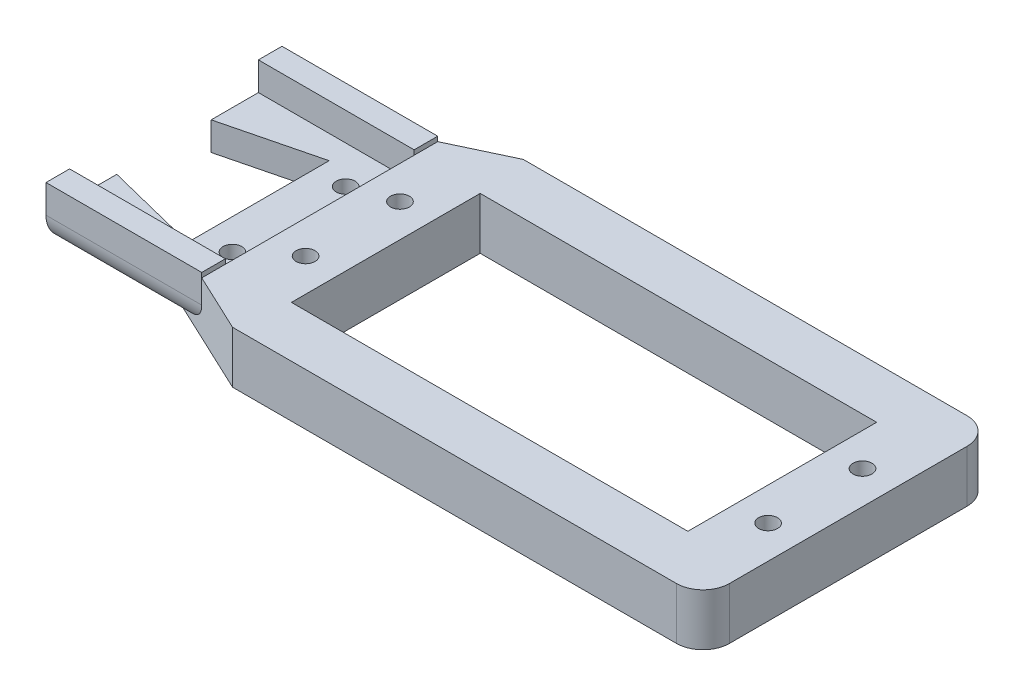
ISO-10303-21;
HEADER;
FILE_DESCRIPTION(('STEP AP214'),'2;1');
FILE_NAME('part.step','',(''),(''),'','','');
FILE_SCHEMA(('AUTOMOTIVE_DESIGN { 1 0 10303 214 1 1 1 1 }'));
ENDSEC;
DATA;
#1=APPLICATION_CONTEXT('core data for automotive mechanical design processes');
#2=APPLICATION_PROTOCOL_DEFINITION('international standard','automotive_design',2000,#1);
#3=PRODUCT_CONTEXT('',#1,'mechanical');
#4=PRODUCT('Part','Part','',(#3));
#5=PRODUCT_RELATED_PRODUCT_CATEGORY('part','',(#4));
#6=PRODUCT_DEFINITION_FORMATION('','',#4);
#7=PRODUCT_DEFINITION_CONTEXT('part definition',#1,'design');
#8=PRODUCT_DEFINITION('design','',#6,#7);
#9=PRODUCT_DEFINITION_SHAPE('','',#8);
#10=(LENGTH_UNIT() NAMED_UNIT(*) SI_UNIT(.MILLI.,.METRE.));
#11=(NAMED_UNIT(*) PLANE_ANGLE_UNIT() SI_UNIT($,.RADIAN.));
#12=(NAMED_UNIT(*) SI_UNIT($,.STERADIAN.) SOLID_ANGLE_UNIT());
#13=UNCERTAINTY_MEASURE_WITH_UNIT(LENGTH_MEASURE(1.E-05),#10,'distance_accuracy_value','');
#14=(GEOMETRIC_REPRESENTATION_CONTEXT(3) GLOBAL_UNCERTAINTY_ASSIGNED_CONTEXT((#13)) GLOBAL_UNIT_ASSIGNED_CONTEXT((#10,
#11,#12)) REPRESENTATION_CONTEXT('',''));
#15=CARTESIAN_POINT('',(0.,0.,0.));
#16=DIRECTION('',(0.,0.,1.));
#17=DIRECTION('',(1.,0.,0.));
#18=AXIS2_PLACEMENT_3D('',#15,#16,#17);
#19=CARTESIAN_POINT('',(-35.503347098961,5.5,-5.12411535777367));
#20=DIRECTION('',(-0.24253562503647,0.,-0.970142500145298));
#21=DIRECTION('',(-0.970142500145298,0.,0.24253562503647));
#22=AXIS2_PLACEMENT_3D('',#19,#20,#21);
#23=PLANE('',#22);
#24=DIRECTION('',(0.970142500145298,0.,-0.24253562503647));
#25=VECTOR('',#24,1.);
#26=CARTESIAN_POINT('',(-35.503347098961,3.,-5.12411535777367));
#27=LINE('',#26,#25);
#28=CARTESIAN_POINT('',(-35.503347098961,3.,-5.12411535777367));
#29=VERTEX_POINT('',#28);
#30=CARTESIAN_POINT('',(-25.504346549651,3.,-7.62386549510267));
#31=VERTEX_POINT('',#30);
#32=EDGE_CURVE('E272',#29,#31,#27,.T.);
#33=ORIENTED_EDGE('',*,*,#32,.F.);
#34=DIRECTION('',(0.,-1.,0.));
#35=VECTOR('',#34,1.);
#36=CARTESIAN_POINT('',(-35.503347098961,5.5,-5.12411535777367));
#37=LINE('',#36,#35);
#38=CARTESIAN_POINT('',(-35.503347098961,0.,-5.12411535777367));
#39=VERTEX_POINT('',#38);
#40=EDGE_CURVE('E510',#29,#39,#37,.T.);
#41=ORIENTED_EDGE('',*,*,#40,.T.);
#42=DIRECTION('',(0.970142500145298,0.,-0.24253562503647));
#43=VECTOR('',#42,1.);
#44=CARTESIAN_POINT('',(-35.503347098961,0.,-5.12411535777367));
#45=LINE('',#44,#43);
#46=CARTESIAN_POINT('',(-25.504346549651,0.,-7.62386549510267));
#47=VERTEX_POINT('',#46);
#48=EDGE_CURVE('E432',#39,#47,#45,.T.);
#49=ORIENTED_EDGE('',*,*,#48,.T.);
#50=DIRECTION('',(0.,-1.,0.));
#51=VECTOR('',#50,1.);
#52=CARTESIAN_POINT('',(-25.504346549651,5.5,-7.62386549510267));
#53=LINE('',#52,#51);
#54=EDGE_CURVE('E507',#31,#47,#53,.T.);
#55=ORIENTED_EDGE('',*,*,#54,.F.);
#56=EDGE_LOOP('',(#33,#41,#49,#55));
#57=FACE_BOUND('',#56,.T.);
#58=ADVANCED_FACE('F39',(#57),#23,.F.);
#59=CARTESIAN_POINT('',(-25.504346549651,5.5,-7.62386549510267));
#60=DIRECTION('',(1.,0.,0.));
#61=DIRECTION('',(0.,0.,-1.));
#62=AXIS2_PLACEMENT_3D('',#59,#60,#61);
#63=PLANE('',#62);
#64=DIRECTION('',(0.,0.,1.));
#65=VECTOR('',#64,1.);
#66=CARTESIAN_POINT('',(-25.504346549651,3.,-7.62386549510267));
#67=LINE('',#66,#65);
#68=CARTESIAN_POINT('',(-25.504346549651,3.,7.37613450489733));
#69=VERTEX_POINT('',#68);
#70=EDGE_CURVE('E269',#31,#69,#67,.T.);
#71=ORIENTED_EDGE('',*,*,#70,.F.);
#72=ORIENTED_EDGE('',*,*,#54,.T.);
#73=DIRECTION('',(0.,0.,1.));
#74=VECTOR('',#73,1.);
#75=CARTESIAN_POINT('',(-25.504346549651,0.,-7.62386549510267));
#76=LINE('',#75,#74);
#77=CARTESIAN_POINT('',(-25.504346549651,0.,7.37613450489733));
#78=VERTEX_POINT('',#77);
#79=EDGE_CURVE('E436',#47,#78,#76,.T.);
#80=ORIENTED_EDGE('',*,*,#79,.T.);
#81=DIRECTION('',(0.,-1.,0.));
#82=VECTOR('',#81,1.);
#83=CARTESIAN_POINT('',(-25.504346549651,5.5,7.37613450489733));
#84=LINE('',#83,#82);
#85=EDGE_CURVE('E504',#69,#78,#84,.T.);
#86=ORIENTED_EDGE('',*,*,#85,.F.);
#87=EDGE_LOOP('',(#71,#72,#80,#86));
#88=FACE_BOUND('',#87,.T.);
#89=ADVANCED_FACE('F640',(#88),#63,.F.);
#90=CARTESIAN_POINT('',(-25.504346549651,5.5,7.37613450489733));
#91=DIRECTION('',(-0.24253562503647,0.,0.970142500145298));
#92=DIRECTION('',(0.970142500145298,0.,0.24253562503647));
#93=AXIS2_PLACEMENT_3D('',#90,#91,#92);
#94=PLANE('',#93);
#95=DIRECTION('',(-0.970142500145298,0.,-0.24253562503647));
#96=VECTOR('',#95,1.);
#97=CARTESIAN_POINT('',(-25.504346549651,3.,7.37613450489733));
#98=LINE('',#97,#96);
#99=CARTESIAN_POINT('',(-35.503347098961,3.,4.87638436756833));
#100=VERTEX_POINT('',#99);
#101=EDGE_CURVE('E234',#69,#100,#98,.T.);
#102=ORIENTED_EDGE('',*,*,#101,.F.);
#103=ORIENTED_EDGE('',*,*,#85,.T.);
#104=DIRECTION('',(-0.970142500145298,0.,-0.24253562503647));
#105=VECTOR('',#104,1.);
#106=CARTESIAN_POINT('',(-25.504346549651,0.,7.37613450489733));
#107=LINE('',#106,#105);
#108=CARTESIAN_POINT('',(-35.503347098961,0.,4.87638436756833));
#109=VERTEX_POINT('',#108);
#110=EDGE_CURVE('E440',#78,#109,#107,.T.);
#111=ORIENTED_EDGE('',*,*,#110,.T.);
#112=DIRECTION('',(0.,-1.,0.));
#113=VECTOR('',#112,1.);
#114=CARTESIAN_POINT('',(-35.503347098961,5.5,4.87638436756833));
#115=LINE('',#114,#113);
#116=EDGE_CURVE('E501',#100,#109,#115,.T.);
#117=ORIENTED_EDGE('',*,*,#116,.F.);
#118=EDGE_LOOP('',(#102,#103,#111,#117));
#119=FACE_BOUND('',#118,.T.);
#120=ADVANCED_FACE('F645',(#119),#94,.F.);
#121=CARTESIAN_POINT('',(-22.2543463720277,5.5,-6.1238652786694));
#122=DIRECTION('',(0.,-1.,0.));
#123=DIRECTION('',(0.,0.,-1.));
#124=AXIS2_PLACEMENT_3D('',#121,#122,#123);
#125=CYLINDRICAL_SURFACE('',#124,1.00000021643328);
#126=CARTESIAN_POINT('',(-22.2543463720277,0.,-6.1238652786694));
#127=DIRECTION('',(0.,1.,0.));
#128=DIRECTION('',(0.,0.,1.));
#129=AXIS2_PLACEMENT_3D('',#126,#127,#128);
#130=CIRCLE('',#129,1.00000021643328);
#131=CARTESIAN_POINT('',(-22.2543463720277,0.,-5.12386506223612));
#132=VERTEX_POINT('',#131);
#133=EDGE_CURVE('E356',#132,#132,#130,.T.);
#134=ORIENTED_EDGE('',*,*,#133,.F.);
#135=EDGE_LOOP('',(#134));
#136=FACE_BOUND('',#135,.T.);
#137=CARTESIAN_POINT('',(-22.2543463720277,3.,-6.1238652786694));
#138=DIRECTION('',(0.,1.,0.));
#139=DIRECTION('',(0.,0.,1.));
#140=AXIS2_PLACEMENT_3D('',#137,#138,#139);
#141=CIRCLE('',#140,1.00000021643328);
#142=CARTESIAN_POINT('',(-22.2543463720277,3.,-5.12386506223612));
#143=VERTEX_POINT('',#142);
#144=EDGE_CURVE('E263',#143,#143,#141,.T.);
#145=ORIENTED_EDGE('',*,*,#144,.T.);
#146=EDGE_LOOP('',(#145));
#147=FACE_BOUND('',#146,.T.);
#148=ADVANCED_FACE('F881',(#136,#147),#125,.F.);
#149=CARTESIAN_POINT('',(-22.2543454835007,5.5,5.8761350910162));
#150=DIRECTION('',(0.,-1.,0.));
#151=DIRECTION('',(0.,0.,-1.));
#152=AXIS2_PLACEMENT_3D('',#149,#150,#151);
#153=CYLINDRICAL_SURFACE('',#152,1.00000059267607);
#154=CARTESIAN_POINT('',(-22.2543454835007,0.,5.8761350910162));
#155=DIRECTION('',(0.,1.,0.));
#156=DIRECTION('',(0.,0.,1.));
#157=AXIS2_PLACEMENT_3D('',#154,#155,#156);
#158=CIRCLE('',#157,1.00000059267607);
#159=CARTESIAN_POINT('',(-22.2543454835007,0.,6.87613568369227));
#160=VERTEX_POINT('',#159);
#161=EDGE_CURVE('E323',#160,#160,#158,.T.);
#162=ORIENTED_EDGE('',*,*,#161,.F.);
#163=EDGE_LOOP('',(#162));
#164=FACE_BOUND('',#163,.T.);
#165=CARTESIAN_POINT('',(-22.2543454835007,3.,5.8761350910162));
#166=DIRECTION('',(0.,1.,0.));
#167=DIRECTION('',(0.,0.,1.));
#168=AXIS2_PLACEMENT_3D('',#165,#166,#167);
#169=CIRCLE('',#168,1.00000059267607);
#170=CARTESIAN_POINT('',(-22.2543454835007,3.,6.87613568369227));
#171=VERTEX_POINT('',#170);
#172=EDGE_CURVE('E260',#171,#171,#169,.T.);
#173=ORIENTED_EDGE('',*,*,#172,.T.);
#174=EDGE_LOOP('',(#173));
#175=FACE_BOUND('',#174,.T.);
#176=ADVANCED_FACE('F844',(#164,#175),#153,.F.);
#177=CARTESIAN_POINT('',(34.1836718745476,5.5,12.4641535012919));
#178=DIRECTION('',(0.,1.,0.));
#179=DIRECTION('',(0.,0.,1.));
#180=AXIS2_PLACEMENT_3D('',#177,#178,#179);
#181=PLANE('',#180);
#182=DIRECTION('',(0.,0.,-1.));
#183=VECTOR('',#182,1.);
#184=CARTESIAN_POINT('',(-19.003347098961,5.5,-10.1238654951027));
#185=LINE('',#184,#183);
#186=CARTESIAN_POINT('',(-19.003347098961,5.5,9.87613450489733));
#187=VERTEX_POINT('',#186);
#188=CARTESIAN_POINT('',(-19.003347098961,5.5,-10.1238654951027));
#189=VERTEX_POINT('',#188);
#190=EDGE_CURVE('E237',#187,#189,#185,.T.);
#191=ORIENTED_EDGE('',*,*,#190,.F.);
#192=DIRECTION('',(0.,0.,-1.));
#193=VECTOR('',#192,1.);
#194=CARTESIAN_POINT('',(-19.003347098961,5.5,12.3761345048973));
#195=LINE('',#194,#193);
#196=CARTESIAN_POINT('',(-19.003347098961,5.5,12.3761345048973));
#197=VERTEX_POINT('',#196);
#198=EDGE_CURVE('E303',#197,#187,#195,.T.);
#199=ORIENTED_EDGE('',*,*,#198,.F.);
#200=DIRECTION('',(0.904851322774388,0.,0.425727710718296));
#201=VECTOR('',#200,1.);
#202=CARTESIAN_POINT('',(-19.003347098961,5.5,12.3761345048973));
#203=LINE('',#202,#201);
#204=CARTESIAN_POINT('',(-12.839622199671,5.5,15.2761341234273));
#205=VERTEX_POINT('',#204);
#206=EDGE_CURVE('E407',#197,#205,#203,.T.);
#207=ORIENTED_EDGE('',*,*,#206,.T.);
#208=DIRECTION('',(0.999999992076792,0.,-0.000125882545951451));
#209=VECTOR('',#208,1.);
#210=CARTESIAN_POINT('',(-12.839622199671,5.5,15.2761341234273));
#211=LINE('',#210,#209);
#212=CARTESIAN_POINT('',(34.184025108674,5.5,15.2702146669373));
#213=VERTEX_POINT('',#212);
#214=EDGE_CURVE('E410',#205,#213,#211,.T.);
#215=ORIENTED_EDGE('',*,*,#214,.T.);
#216=CARTESIAN_POINT('',(34.1836718745476,5.5,12.4641535012919));
#217=DIRECTION('',(0.,1.,0.));
#218=DIRECTION('',(0.,0.,1.));
#219=AXIS2_PLACEMENT_3D('',#216,#217,#218);
#220=CIRCLE('',#219,2.80606118787843);
#221=CARTESIAN_POINT('',(36.989733040193,5.5,12.4645067354273));
#222=VERTEX_POINT('',#221);
#223=EDGE_CURVE('E414',#213,#222,#220,.T.);
#224=ORIENTED_EDGE('',*,*,#223,.T.);
#225=DIRECTION('',(0.,0.,-1.));
#226=VECTOR('',#225,1.);
#227=CARTESIAN_POINT('',(36.989733040193,5.5,12.4645067354273));
#228=LINE('',#227,#226);
#229=CARTESIAN_POINT('',(36.989733040193,5.5,-12.7122377256327));
#230=VERTEX_POINT('',#229);
#231=EDGE_CURVE('E417',#222,#230,#228,.T.);
#232=ORIENTED_EDGE('',*,*,#231,.T.);
#233=CARTESIAN_POINT('',(34.184025108675,5.5,-12.7122377256327));
#234=DIRECTION('',(0.,1.,0.));
#235=DIRECTION('',(0.,0.,1.));
#236=AXIS2_PLACEMENT_3D('',#233,#234,#235);
#237=CIRCLE('',#236,2.805707931518);
#238=CARTESIAN_POINT('',(34.184025108674,5.5,-15.5179456571507));
#239=VERTEX_POINT('',#238);
#240=EDGE_CURVE('E420',#230,#239,#237,.T.);
#241=ORIENTED_EDGE('',*,*,#240,.T.);
#242=DIRECTION('',(-0.999999992076792,0.,-0.000125882545781312));
#243=VECTOR('',#242,1.);
#244=CARTESIAN_POINT('',(34.184025108674,5.5,-15.5179456571507));
#245=LINE('',#244,#243);
#246=CARTESIAN_POINT('',(-12.839622199671,5.5,-15.5238651136327));
#247=VERTEX_POINT('',#246);
#248=EDGE_CURVE('E423',#239,#247,#245,.T.);
#249=ORIENTED_EDGE('',*,*,#248,.T.);
#250=DIRECTION('',(-0.904851322774388,0.,0.425727710718296));
#251=VECTOR('',#250,1.);
#252=CARTESIAN_POINT('',(-12.839622199671,5.5,-15.5238651136327));
#253=LINE('',#252,#251);
#254=CARTESIAN_POINT('',(-19.003347098961,5.5,-12.6238654951027));
#255=VERTEX_POINT('',#254);
#256=EDGE_CURVE('E426',#247,#255,#253,.T.);
#257=ORIENTED_EDGE('',*,*,#256,.T.);
#258=DIRECTION('',(0.,0.,-1.));
#259=VECTOR('',#258,1.);
#260=CARTESIAN_POINT('',(-19.003347098961,5.5,-12.6238654951027));
#261=LINE('',#260,#259);
#262=EDGE_CURVE('E275',#189,#255,#261,.T.);
#263=ORIENTED_EDGE('',*,*,#262,.F.);
#264=EDGE_LOOP('',(#191,#199,#207,#215,#224,#232,#241,#249,#257,#263));
#265=FACE_BOUND('',#264,.T.);
#266=CARTESIAN_POINT('',(-15.5043476779818,5.5,4.87613492696322));
#267=DIRECTION('',(0.,1.,0.));
#268=DIRECTION('',(0.,0.,1.));
#269=AXIS2_PLACEMENT_3D('',#266,#267,#268);
#270=CIRCLE('',#269,1.00000042442782);
#271=CARTESIAN_POINT('',(-15.5043476779818,5.5,5.87613535139104));
#272=VERTEX_POINT('',#271);
#273=EDGE_CURVE('E328',#272,#272,#270,.T.);
#274=ORIENTED_EDGE('',*,*,#273,.F.);
#275=EDGE_LOOP('',(#274));
#276=FACE_BOUND('',#275,.T.);
#277=CARTESIAN_POINT('',(33.4956533773743,5.5,-5.12386556807738));
#278=DIRECTION('',(0.,1.,0.));
#279=DIRECTION('',(0.,0.,1.));
#280=AXIS2_PLACEMENT_3D('',#277,#278,#279);
#281=CIRCLE('',#280,1.00000007297471);
#282=CARTESIAN_POINT('',(33.4956533773743,5.5,-4.12386549510266));
#283=VERTEX_POINT('',#282);
#284=EDGE_CURVE('E344',#283,#283,#281,.T.);
#285=ORIENTED_EDGE('',*,*,#284,.F.);
#286=EDGE_LOOP('',(#285));
#287=FACE_BOUND('',#286,.T.);
#288=DIRECTION('',(1.,0.,0.));
#289=VECTOR('',#288,1.);
#290=CARTESIAN_POINT('',(-12.004346549651,5.5,9.87613450489733));
#291=LINE('',#290,#289);
#292=CARTESIAN_POINT('',(-12.004346549651,5.5,9.87613450489733));
#293=VERTEX_POINT('',#292);
#294=CARTESIAN_POINT('',(29.995653450349,5.5,9.87613450489733));
#295=VERTEX_POINT('',#294);
#296=EDGE_CURVE('E367',#293,#295,#291,.T.);
#297=ORIENTED_EDGE('',*,*,#296,.F.);
#298=DIRECTION('',(0.,0.,1.));
#299=VECTOR('',#298,1.);
#300=CARTESIAN_POINT('',(-12.004346549651,5.5,-10.1238654951027));
#301=LINE('',#300,#299);
#302=CARTESIAN_POINT('',(-12.004346549651,5.5,-10.1238654951027));
#303=VERTEX_POINT('',#302);
#304=EDGE_CURVE('E364',#303,#293,#301,.T.);
#305=ORIENTED_EDGE('',*,*,#304,.F.);
#306=DIRECTION('',(-1.,0.,0.));
#307=VECTOR('',#306,1.);
#308=CARTESIAN_POINT('',(-12.004346549651,5.5,-10.1238654951027));
#309=LINE('',#308,#307);
#310=CARTESIAN_POINT('',(29.995653450349,5.5,-10.1238654951027));
#311=VERTEX_POINT('',#310);
#312=EDGE_CURVE('E375',#311,#303,#309,.T.);
#313=ORIENTED_EDGE('',*,*,#312,.F.);
#314=DIRECTION('',(0.,0.,-1.));
#315=VECTOR('',#314,1.);
#316=CARTESIAN_POINT('',(29.995653450349,5.5,-10.1238654951027));
#317=LINE('',#316,#315);
#318=EDGE_CURVE('E371',#295,#311,#317,.T.);
#319=ORIENTED_EDGE('',*,*,#318,.F.);
#320=EDGE_LOOP('',(#297,#305,#313,#319));
#321=FACE_BOUND('',#320,.T.);
#322=CARTESIAN_POINT('',(-15.5043468388761,5.5,-5.12386555816893));
#323=DIRECTION('',(0.,1.,0.));
#324=DIRECTION('',(0.,0.,1.));
#325=AXIS2_PLACEMENT_3D('',#322,#323,#324);
#326=CIRCLE('',#325,1.00000006306631);
#327=CARTESIAN_POINT('',(-15.5043468388761,5.5,-4.12386549510263));
#328=VERTEX_POINT('',#327);
#329=EDGE_CURVE('E352',#328,#328,#326,.T.);
#330=ORIENTED_EDGE('',*,*,#329,.F.);
#331=EDGE_LOOP('',(#330));
#332=FACE_BOUND('',#331,.T.);
#333=CARTESIAN_POINT('',(33.4956530999563,5.5,4.87613399686961));
#334=DIRECTION('',(0.,1.,0.));
#335=DIRECTION('',(0.,0.,1.));
#336=AXIS2_PLACEMENT_3D('',#333,#334,#335);
#337=CIRCLE('',#336,0.999999978686177);
#338=CARTESIAN_POINT('',(33.4956530999563,5.5,5.87613397555579));
#339=VERTEX_POINT('',#338);
#340=EDGE_CURVE('E336',#339,#339,#337,.T.);
#341=ORIENTED_EDGE('',*,*,#340,.F.);
#342=EDGE_LOOP('',(#341));
#343=FACE_BOUND('',#342,.T.);
#344=ADVANCED_FACE('F584',(#265,#276,#287,#321,#332,#343),#181,.T.);
#345=CARTESIAN_POINT('',(34.1836718745476,0.,12.4641535012919));
#346=DIRECTION('',(0.,1.,0.));
#347=DIRECTION('',(0.,0.,1.));
#348=AXIS2_PLACEMENT_3D('',#345,#346,#347);
#349=PLANE('',#348);
#350=DIRECTION('',(0.,0.,1.));
#351=VECTOR('',#350,1.);
#352=CARTESIAN_POINT('',(-35.503347098961,0.,-12.6238654951027));
#353=LINE('',#352,#351);
#354=CARTESIAN_POINT('',(-35.503347098961,0.,-9.62386549510267));
#355=VERTEX_POINT('',#354);
#356=EDGE_CURVE('E406',#355,#39,#353,.T.);
#357=ORIENTED_EDGE('',*,*,#356,.F.);
#358=DIRECTION('',(-1.,0.,0.));
#359=VECTOR('',#358,1.);
#360=CARTESIAN_POINT('',(34.1836718745476,0.,-9.62386549510267));
#361=LINE('',#360,#359);
#362=CARTESIAN_POINT('',(-25.3796150749006,0.,-9.62386549510267));
#363=VERTEX_POINT('',#362);
#364=EDGE_CURVE('E531',#355,#363,#361,.F.);
#365=ORIENTED_EDGE('',*,*,#364,.T.);
#366=DIRECTION('',(-0.904851322774388,0.,0.425727710718296));
#367=VECTOR('',#366,1.);
#368=CARTESIAN_POINT('',(-12.839622199671,0.,-15.5238651136327));
#369=LINE('',#368,#367);
#370=CARTESIAN_POINT('',(-12.839622199671,0.,-15.5238651136327));
#371=VERTEX_POINT('',#370);
#372=EDGE_CURVE('E411',#371,#363,#369,.T.);
#373=ORIENTED_EDGE('',*,*,#372,.F.);
#374=DIRECTION('',(-0.999999992076792,0.,-0.000125882545781312));
#375=VECTOR('',#374,1.);
#376=CARTESIAN_POINT('',(34.184025108674,0.,-15.5179456571507));
#377=LINE('',#376,#375);
#378=CARTESIAN_POINT('',(34.184025108674,0.,-15.5179456571507));
#379=VERTEX_POINT('',#378);
#380=EDGE_CURVE('E462',#379,#371,#377,.T.);
#381=ORIENTED_EDGE('',*,*,#380,.F.);
#382=CARTESIAN_POINT('',(34.184025108675,0.,-12.7122377256327));
#383=DIRECTION('',(0.,1.,0.));
#384=DIRECTION('',(0.,0.,1.));
#385=AXIS2_PLACEMENT_3D('',#382,#383,#384);
#386=CIRCLE('',#385,2.805707931518);
#387=CARTESIAN_POINT('',(36.989733040193,0.,-12.7122377256327));
#388=VERTEX_POINT('',#387);
#389=EDGE_CURVE('E459',#388,#379,#386,.T.);
#390=ORIENTED_EDGE('',*,*,#389,.F.);
#391=DIRECTION('',(0.,0.,-1.));
#392=VECTOR('',#391,1.);
#393=CARTESIAN_POINT('',(36.989733040193,0.,12.4645067354273));
#394=LINE('',#393,#392);
#395=CARTESIAN_POINT('',(36.989733040193,0.,12.4645067354273));
#396=VERTEX_POINT('',#395);
#397=EDGE_CURVE('E456',#396,#388,#394,.T.);
#398=ORIENTED_EDGE('',*,*,#397,.F.);
#399=CARTESIAN_POINT('',(34.1836718745476,0.,12.4641535012919));
#400=DIRECTION('',(0.,1.,0.));
#401=DIRECTION('',(0.,0.,1.));
#402=AXIS2_PLACEMENT_3D('',#399,#400,#401);
#403=CIRCLE('',#402,2.80606118787843);
#404=CARTESIAN_POINT('',(34.184025108674,0.,15.2702146669373));
#405=VERTEX_POINT('',#404);
#406=EDGE_CURVE('E453',#405,#396,#403,.T.);
#407=ORIENTED_EDGE('',*,*,#406,.F.);
#408=DIRECTION('',(0.999999992076792,0.,-0.000125882545951451));
#409=VECTOR('',#408,1.);
#410=CARTESIAN_POINT('',(-12.839622199671,0.,15.2761341234273));
#411=LINE('',#410,#409);
#412=CARTESIAN_POINT('',(-12.839622199671,0.,15.2761341234273));
#413=VERTEX_POINT('',#412);
#414=EDGE_CURVE('E450',#413,#405,#411,.T.);
#415=ORIENTED_EDGE('',*,*,#414,.F.);
#416=DIRECTION('',(0.904851322774388,0.,0.425727710718296));
#417=VECTOR('',#416,1.);
#418=CARTESIAN_POINT('',(-19.003347098961,0.,12.3761345048973));
#419=LINE('',#418,#417);
#420=CARTESIAN_POINT('',(-25.3796150749006,0.,9.37613450489733));
#421=VERTEX_POINT('',#420);
#422=EDGE_CURVE('E447',#421,#413,#419,.T.);
#423=ORIENTED_EDGE('',*,*,#422,.F.);
#424=DIRECTION('',(1.,0.,0.));
#425=VECTOR('',#424,1.);
#426=CARTESIAN_POINT('',(34.1836718745476,0.,9.37613450489733));
#427=LINE('',#426,#425);
#428=CARTESIAN_POINT('',(-35.503347098961,0.,9.37613450489733));
#429=VERTEX_POINT('',#428);
#430=EDGE_CURVE('E528',#421,#429,#427,.F.);
#431=ORIENTED_EDGE('',*,*,#430,.T.);
#432=DIRECTION('',(0.,0.,1.));
#433=VECTOR('',#432,1.);
#434=CARTESIAN_POINT('',(-35.503347098961,0.,4.87638436756833));
#435=LINE('',#434,#433);
#436=EDGE_CURVE('E444',#109,#429,#435,.T.);
#437=ORIENTED_EDGE('',*,*,#436,.F.);
#438=ORIENTED_EDGE('',*,*,#110,.F.);
#439=ORIENTED_EDGE('',*,*,#79,.F.);
#440=ORIENTED_EDGE('',*,*,#48,.F.);
#441=EDGE_LOOP('',(#357,#365,#373,#381,#390,#398,#407,#415,#423,#431,#437,#438,#439,#440));
#442=FACE_BOUND('',#441,.T.);
#443=DIRECTION('',(0.,0.,1.));
#444=VECTOR('',#443,1.);
#445=CARTESIAN_POINT('',(-12.004346549651,0.,-10.1238654951027));
#446=LINE('',#445,#444);
#447=CARTESIAN_POINT('',(-12.004346549651,0.,-10.1238654951027));
#448=VERTEX_POINT('',#447);
#449=CARTESIAN_POINT('',(-12.004346549651,0.,9.87613450489733));
#450=VERTEX_POINT('',#449);
#451=EDGE_CURVE('E363',#448,#450,#446,.T.);
#452=ORIENTED_EDGE('',*,*,#451,.T.);
#453=DIRECTION('',(1.,0.,0.));
#454=VECTOR('',#453,1.);
#455=CARTESIAN_POINT('',(-12.004346549651,0.,9.87613450489733));
#456=LINE('',#455,#454);
#457=CARTESIAN_POINT('',(29.995653450349,0.,9.87613450489733));
#458=VERTEX_POINT('',#457);
#459=EDGE_CURVE('E382',#450,#458,#456,.T.);
#460=ORIENTED_EDGE('',*,*,#459,.T.);
#461=DIRECTION('',(0.,0.,-1.));
#462=VECTOR('',#461,1.);
#463=CARTESIAN_POINT('',(29.995653450349,0.,-10.1238654951027));
#464=LINE('',#463,#462);
#465=CARTESIAN_POINT('',(29.995653450349,0.,-10.1238654951027));
#466=VERTEX_POINT('',#465);
#467=EDGE_CURVE('E386',#458,#466,#464,.T.);
#468=ORIENTED_EDGE('',*,*,#467,.T.);
#469=DIRECTION('',(-1.,0.,0.));
#470=VECTOR('',#469,1.);
#471=CARTESIAN_POINT('',(-12.004346549651,0.,-10.1238654951027));
#472=LINE('',#471,#470);
#473=EDGE_CURVE('E368',#466,#448,#472,.T.);
#474=ORIENTED_EDGE('',*,*,#473,.T.);
#475=EDGE_LOOP('',(#452,#460,#468,#474));
#476=FACE_BOUND('',#475,.T.);
#477=ORIENTED_EDGE('',*,*,#133,.T.);
#478=EDGE_LOOP('',(#477));
#479=FACE_BOUND('',#478,.T.);
#480=CARTESIAN_POINT('',(-15.5043468388761,0.,-5.12386555816893));
#481=DIRECTION('',(0.,1.,0.));
#482=DIRECTION('',(0.,0.,1.));
#483=AXIS2_PLACEMENT_3D('',#480,#481,#482);
#484=CIRCLE('',#483,1.00000006306631);
#485=CARTESIAN_POINT('',(-15.5043468388761,0.,-4.12386549510263));
#486=VERTEX_POINT('',#485);
#487=EDGE_CURVE('E348',#486,#486,#484,.T.);
#488=ORIENTED_EDGE('',*,*,#487,.T.);
#489=EDGE_LOOP('',(#488));
#490=FACE_BOUND('',#489,.T.);
#491=CARTESIAN_POINT('',(33.4956533773743,0.,-5.12386556807738));
#492=DIRECTION('',(0.,1.,0.));
#493=DIRECTION('',(0.,0.,1.));
#494=AXIS2_PLACEMENT_3D('',#491,#492,#493);
#495=CIRCLE('',#494,1.00000007297471);
#496=CARTESIAN_POINT('',(33.4956533773743,0.,-4.12386549510266));
#497=VERTEX_POINT('',#496);
#498=EDGE_CURVE('E340',#497,#497,#495,.T.);
#499=ORIENTED_EDGE('',*,*,#498,.T.);
#500=EDGE_LOOP('',(#499));
#501=FACE_BOUND('',#500,.T.);
#502=CARTESIAN_POINT('',(33.4956530999563,0.,4.87613399686961));
#503=DIRECTION('',(0.,1.,0.));
#504=DIRECTION('',(0.,0.,1.));
#505=AXIS2_PLACEMENT_3D('',#502,#503,#504);
#506=CIRCLE('',#505,0.999999978686177);
#507=CARTESIAN_POINT('',(33.4956530999563,0.,5.87613397555579));
#508=VERTEX_POINT('',#507);
#509=EDGE_CURVE('E332',#508,#508,#506,.T.);
#510=ORIENTED_EDGE('',*,*,#509,.T.);
#511=EDGE_LOOP('',(#510));
#512=FACE_BOUND('',#511,.T.);
#513=CARTESIAN_POINT('',(-15.5043476779818,0.,4.87613492696322));
#514=DIRECTION('',(0.,1.,0.));
#515=DIRECTION('',(0.,0.,1.));
#516=AXIS2_PLACEMENT_3D('',#513,#514,#515);
#517=CIRCLE('',#516,1.00000042442782);
#518=CARTESIAN_POINT('',(-15.5043476779818,0.,5.87613535139104));
#519=VERTEX_POINT('',#518);
#520=EDGE_CURVE('E327',#519,#519,#517,.T.);
#521=ORIENTED_EDGE('',*,*,#520,.T.);
#522=EDGE_LOOP('',(#521));
#523=FACE_BOUND('',#522,.T.);
#524=ORIENTED_EDGE('',*,*,#161,.T.);
#525=EDGE_LOOP('',(#524));
#526=FACE_BOUND('',#525,.T.);
#527=ADVANCED_FACE('F561',(#442,#476,#479,#490,#501,#512,#523,#526),#349,.F.);
#528=CARTESIAN_POINT('',(-19.003347098961,5.5,-12.6238654951027));
#529=DIRECTION('',(0.,0.,1.));
#530=DIRECTION('',(1.,0.,0.));
#531=AXIS2_PLACEMENT_3D('',#528,#529,#530);
#532=PLANE('',#531);
#533=DIRECTION('',(0.,-1.,0.));
#534=VECTOR('',#533,1.);
#535=CARTESIAN_POINT('',(-19.003347098961,5.5,-12.6238654951027));
#536=LINE('',#535,#534);
#537=CARTESIAN_POINT('',(-19.003347098961,3.,-12.6238654951027));
#538=VERTEX_POINT('',#537);
#539=EDGE_CURVE('E429',#255,#538,#536,.T.);
#540=ORIENTED_EDGE('',*,*,#539,.T.);
#541=DIRECTION('',(-1.,0.,0.));
#542=VECTOR('',#541,1.);
#543=CARTESIAN_POINT('',(-19.003347098961,3.,-12.6238654951027));
#544=LINE('',#543,#542);
#545=CARTESIAN_POINT('',(-35.503347098961,3.,-12.6238654951027));
#546=VERTEX_POINT('',#545);
#547=EDGE_CURVE('E518',#538,#546,#544,.T.);
#548=ORIENTED_EDGE('',*,*,#547,.T.);
#549=DIRECTION('',(0.,-1.,0.));
#550=VECTOR('',#549,1.);
#551=CARTESIAN_POINT('',(-35.503347098961,5.5,-12.6238654951027));
#552=LINE('',#551,#550);
#553=CARTESIAN_POINT('',(-35.503347098961,6.,-12.6238654951027));
#554=VERTEX_POINT('',#553);
#555=EDGE_CURVE('E514',#554,#546,#552,.T.);
#556=ORIENTED_EDGE('',*,*,#555,.F.);
#557=DIRECTION('',(-1.,0.,0.));
#558=VECTOR('',#557,1.);
#559=CARTESIAN_POINT('',(-35.503347098961,6.,-12.6238654951027));
#560=LINE('',#559,#558);
#561=CARTESIAN_POINT('',(-19.003347098961,6.,-12.6238654951027));
#562=VERTEX_POINT('',#561);
#563=EDGE_CURVE('E276',#562,#554,#560,.T.);
#564=ORIENTED_EDGE('',*,*,#563,.F.);
#565=DIRECTION('',(0.,-1.,0.));
#566=VECTOR('',#565,1.);
#567=CARTESIAN_POINT('',(-19.003347098961,6.,-12.6238654951027));
#568=LINE('',#567,#566);
#569=EDGE_CURVE('E289',#562,#255,#568,.T.);
#570=ORIENTED_EDGE('',*,*,#569,.T.);
#571=EDGE_LOOP('',(#540,#548,#556,#564,#570));
#572=FACE_BOUND('',#571,.T.);
#573=ADVANCED_FACE('F550',(#572),#532,.F.);
#574=CARTESIAN_POINT('',(-35.503347098961,5.5,-12.6238654951027));
#575=DIRECTION('',(1.,0.,0.));
#576=DIRECTION('',(0.,0.,-1.));
#577=AXIS2_PLACEMENT_3D('',#574,#575,#576);
#578=PLANE('',#577);
#579=ORIENTED_EDGE('',*,*,#555,.T.);
#580=CARTESIAN_POINT('',(-35.503347098961,3.,-9.62386549510267));
#581=DIRECTION('',(1.,0.,0.));
#582=DIRECTION('',(0.,0.,-1.));
#583=AXIS2_PLACEMENT_3D('',#580,#581,#582);
#584=CIRCLE('',#583,3.);
#585=EDGE_CURVE('E525',#546,#355,#584,.F.);
#586=ORIENTED_EDGE('',*,*,#585,.T.);
#587=ORIENTED_EDGE('',*,*,#356,.T.);
#588=ORIENTED_EDGE('',*,*,#40,.F.);
#589=DIRECTION('',(0.,0.,1.));
#590=VECTOR('',#589,1.);
#591=CARTESIAN_POINT('',(-35.503347098961,3.,-10.1238654951027));
#592=LINE('',#591,#590);
#593=CARTESIAN_POINT('',(-35.503347098961,3.,-10.1238654951027));
#594=VERTEX_POINT('',#593);
#595=EDGE_CURVE('E236',#594,#29,#592,.T.);
#596=ORIENTED_EDGE('',*,*,#595,.F.);
#597=DIRECTION('',(0.,-1.,0.));
#598=VECTOR('',#597,1.);
#599=CARTESIAN_POINT('',(-35.503347098961,6.,-10.1238654951027));
#600=LINE('',#599,#598);
#601=CARTESIAN_POINT('',(-35.503347098961,6.,-10.1238654951027));
#602=VERTEX_POINT('',#601);
#603=EDGE_CURVE('E300',#602,#594,#600,.T.);
#604=ORIENTED_EDGE('',*,*,#603,.F.);
#605=DIRECTION('',(0.,0.,1.));
#606=VECTOR('',#605,1.);
#607=CARTESIAN_POINT('',(-35.503347098961,6.,-12.6238654951027));
#608=LINE('',#607,#606);
#609=EDGE_CURVE('E280',#554,#602,#608,.T.);
#610=ORIENTED_EDGE('',*,*,#609,.F.);
#611=EDGE_LOOP('',(#579,#586,#587,#588,#596,#604,#610));
#612=FACE_BOUND('',#611,.T.);
#613=ADVANCED_FACE('F556',(#612),#578,.F.);
#614=CARTESIAN_POINT('',(-35.503347098961,5.5,4.87638436756833));
#615=DIRECTION('',(1.,0.,0.));
#616=DIRECTION('',(0.,0.,-1.));
#617=AXIS2_PLACEMENT_3D('',#614,#615,#616);
#618=PLANE('',#617);
#619=ORIENTED_EDGE('',*,*,#436,.T.);
#620=CARTESIAN_POINT('',(-35.503347098961,3.,9.37613450489733));
#621=DIRECTION('',(1.,0.,0.));
#622=DIRECTION('',(0.,0.,-1.));
#623=AXIS2_PLACEMENT_3D('',#620,#621,#622);
#624=CIRCLE('',#623,3.);
#625=CARTESIAN_POINT('',(-35.503347098961,3.,12.3761345048973));
#626=VERTEX_POINT('',#625);
#627=EDGE_CURVE('E55',#429,#626,#624,.F.);
#628=ORIENTED_EDGE('',*,*,#627,.T.);
#629=DIRECTION('',(0.,-1.,0.));
#630=VECTOR('',#629,1.);
#631=CARTESIAN_POINT('',(-35.503347098961,5.5,12.3761345048973));
#632=LINE('',#631,#630);
#633=CARTESIAN_POINT('',(-35.503347098961,6.,12.3761345048973));
#634=VERTEX_POINT('',#633);
#635=EDGE_CURVE('E498',#634,#626,#632,.T.);
#636=ORIENTED_EDGE('',*,*,#635,.F.);
#637=DIRECTION('',(0.,0.,1.));
#638=VECTOR('',#637,1.);
#639=CARTESIAN_POINT('',(-35.503347098961,6.,12.3761345048973));
#640=LINE('',#639,#638);
#641=CARTESIAN_POINT('',(-35.503347098961,6.,9.87613450489733));
#642=VERTEX_POINT('',#641);
#643=EDGE_CURVE('E220',#642,#634,#640,.T.);
#644=ORIENTED_EDGE('',*,*,#643,.F.);
#645=DIRECTION('',(0.,-1.,0.));
#646=VECTOR('',#645,1.);
#647=CARTESIAN_POINT('',(-35.503347098961,6.,9.87613450489733));
#648=LINE('',#647,#646);
#649=CARTESIAN_POINT('',(-35.503347098961,3.,9.87613450489733));
#650=VERTEX_POINT('',#649);
#651=EDGE_CURVE('E214',#642,#650,#648,.T.);
#652=ORIENTED_EDGE('',*,*,#651,.T.);
#653=EDGE_CURVE('E217',#100,#650,#592,.T.);
#654=ORIENTED_EDGE('',*,*,#653,.F.);
#655=ORIENTED_EDGE('',*,*,#116,.T.);
#656=EDGE_LOOP('',(#619,#628,#636,#644,#652,#654,#655));
#657=FACE_BOUND('',#656,.T.);
#658=ADVANCED_FACE('F216',(#657),#618,.F.);
#659=CARTESIAN_POINT('',(-35.503347098961,5.5,12.3761345048973));
#660=DIRECTION('',(0.,0.,-1.));
#661=DIRECTION('',(-1.,0.,0.));
#662=AXIS2_PLACEMENT_3D('',#659,#660,#661);
#663=PLANE('',#662);
#664=ORIENTED_EDGE('',*,*,#635,.T.);
#665=DIRECTION('',(1.,0.,0.));
#666=VECTOR('',#665,1.);
#667=CARTESIAN_POINT('',(-35.503347098961,3.,12.3761345048973));
#668=LINE('',#667,#666);
#669=CARTESIAN_POINT('',(-19.003347098961,3.,12.3761345048973));
#670=VERTEX_POINT('',#669);
#671=EDGE_CURVE('E535',#626,#670,#668,.T.);
#672=ORIENTED_EDGE('',*,*,#671,.T.);
#673=DIRECTION('',(0.,-1.,0.));
#674=VECTOR('',#673,1.);
#675=CARTESIAN_POINT('',(-19.003347098961,5.5,12.3761345048973));
#676=LINE('',#675,#674);
#677=EDGE_CURVE('E494',#197,#670,#676,.T.);
#678=ORIENTED_EDGE('',*,*,#677,.F.);
#679=DIRECTION('',(0.,-1.,0.));
#680=VECTOR('',#679,1.);
#681=CARTESIAN_POINT('',(-19.003347098961,6.,12.3761345048973));
#682=LINE('',#681,#680);
#683=CARTESIAN_POINT('',(-19.003347098961,6.,12.3761345048973));
#684=VERTEX_POINT('',#683);
#685=EDGE_CURVE('E319',#684,#197,#682,.T.);
#686=ORIENTED_EDGE('',*,*,#685,.F.);
#687=DIRECTION('',(1.,0.,0.));
#688=VECTOR('',#687,1.);
#689=CARTESIAN_POINT('',(-35.503347098961,6.,12.3761345048973));
#690=LINE('',#689,#688);
#691=EDGE_CURVE('E306',#634,#684,#690,.T.);
#692=ORIENTED_EDGE('',*,*,#691,.F.);
#693=EDGE_LOOP('',(#664,#672,#678,#686,#692));
#694=FACE_BOUND('',#693,.T.);
#695=ADVANCED_FACE('F618',(#694),#663,.F.);
#696=CARTESIAN_POINT('',(-19.003347098961,5.5,12.3761345048973));
#697=DIRECTION('',(0.425727710718296,0.,-0.904851322774388));
#698=DIRECTION('',(-0.904851322774388,0.,-0.425727710718296));
#699=AXIS2_PLACEMENT_3D('',#696,#697,#698);
#700=PLANE('',#699);
#701=ORIENTED_EDGE('',*,*,#422,.T.);
#702=DIRECTION('',(0.,-1.,0.));
#703=VECTOR('',#702,1.);
#704=CARTESIAN_POINT('',(-12.839622199671,5.5,15.2761341234273));
#705=LINE('',#704,#703);
#706=EDGE_CURVE('E490',#205,#413,#705,.T.);
#707=ORIENTED_EDGE('',*,*,#706,.F.);
#708=ORIENTED_EDGE('',*,*,#206,.F.);
#709=ORIENTED_EDGE('',*,*,#677,.T.);
#710=CARTESIAN_POINT('',(-25.3796150749006,3.,9.37613450489733));
#711=DIRECTION('',(0.425727710718296,0.,-0.904851322774388));
#712=DIRECTION('',(0.904851322774388,0.,0.425727710718296));
#713=AXIS2_PLACEMENT_3D('',#710,#711,#712);
#714=ELLIPSE('',#713,7.04675764454784,3.);
#715=EDGE_CURVE('E11',#670,#421,#714,.T.);
#716=ORIENTED_EDGE('',*,*,#715,.T.);
#717=EDGE_LOOP('',(#701,#707,#708,#709,#716));
#718=FACE_BOUND('',#717,.T.);
#719=ADVANCED_FACE('F614',(#718),#700,.F.);
#720=CARTESIAN_POINT('',(-12.839622199671,5.5,15.2761341234273));
#721=DIRECTION('',(-0.000125882545951451,0.,-0.999999992076792));
#722=DIRECTION('',(-0.999999992076792,0.,0.000125882545951451));
#723=AXIS2_PLACEMENT_3D('',#720,#721,#722);
#724=PLANE('',#723);
#725=ORIENTED_EDGE('',*,*,#414,.T.);
#726=DIRECTION('',(0.,-1.,0.));
#727=VECTOR('',#726,1.);
#728=CARTESIAN_POINT('',(34.184025108674,5.5,15.2702146669373));
#729=LINE('',#728,#727);
#730=EDGE_CURVE('E486',#213,#405,#729,.T.);
#731=ORIENTED_EDGE('',*,*,#730,.F.);
#732=ORIENTED_EDGE('',*,*,#214,.F.);
#733=ORIENTED_EDGE('',*,*,#706,.T.);
#734=EDGE_LOOP('',(#725,#731,#732,#733));
#735=FACE_BOUND('',#734,.T.);
#736=ADVANCED_FACE('F610',(#735),#724,.F.);
#737=CARTESIAN_POINT('',(34.1836718745476,5.5,12.4641535012919));
#738=DIRECTION('',(0.,-1.,0.));
#739=DIRECTION('',(0.,0.,-1.));
#740=AXIS2_PLACEMENT_3D('',#737,#738,#739);
#741=CYLINDRICAL_SURFACE('',#740,2.80606118787843);
#742=ORIENTED_EDGE('',*,*,#406,.T.);
#743=DIRECTION('',(0.,-1.,0.));
#744=VECTOR('',#743,1.);
#745=CARTESIAN_POINT('',(36.989733040193,5.5,12.4645067354273));
#746=LINE('',#745,#744);
#747=EDGE_CURVE('E482',#222,#396,#746,.T.);
#748=ORIENTED_EDGE('',*,*,#747,.F.);
#749=ORIENTED_EDGE('',*,*,#223,.F.);
#750=ORIENTED_EDGE('',*,*,#730,.T.);
#751=EDGE_LOOP('',(#742,#748,#749,#750));
#752=FACE_BOUND('',#751,.T.);
#753=ADVANCED_FACE('F605',(#752),#741,.T.);
#754=CARTESIAN_POINT('',(36.989733040193,5.5,12.4645067354273));
#755=DIRECTION('',(-1.,0.,0.));
#756=DIRECTION('',(0.,0.,1.));
#757=AXIS2_PLACEMENT_3D('',#754,#755,#756);
#758=PLANE('',#757);
#759=ORIENTED_EDGE('',*,*,#397,.T.);
#760=DIRECTION('',(0.,-1.,0.));
#761=VECTOR('',#760,1.);
#762=CARTESIAN_POINT('',(36.989733040193,5.5,-12.7122377256327));
#763=LINE('',#762,#761);
#764=EDGE_CURVE('E478',#230,#388,#763,.T.);
#765=ORIENTED_EDGE('',*,*,#764,.F.);
#766=ORIENTED_EDGE('',*,*,#231,.F.);
#767=ORIENTED_EDGE('',*,*,#747,.T.);
#768=EDGE_LOOP('',(#759,#765,#766,#767));
#769=FACE_BOUND('',#768,.T.);
#770=ADVANCED_FACE('F600',(#769),#758,.F.);
#771=CARTESIAN_POINT('',(34.184025108675,5.5,-12.7122377256327));
#772=DIRECTION('',(0.,-1.,0.));
#773=DIRECTION('',(0.,0.,-1.));
#774=AXIS2_PLACEMENT_3D('',#771,#772,#773);
#775=CYLINDRICAL_SURFACE('',#774,2.805707931518);
#776=ORIENTED_EDGE('',*,*,#389,.T.);
#777=DIRECTION('',(0.,-1.,0.));
#778=VECTOR('',#777,1.);
#779=CARTESIAN_POINT('',(34.184025108674,5.5,-15.5179456571507));
#780=LINE('',#779,#778);
#781=EDGE_CURVE('E474',#239,#379,#780,.T.);
#782=ORIENTED_EDGE('',*,*,#781,.F.);
#783=ORIENTED_EDGE('',*,*,#240,.F.);
#784=ORIENTED_EDGE('',*,*,#764,.T.);
#785=EDGE_LOOP('',(#776,#782,#783,#784));
#786=FACE_BOUND('',#785,.T.);
#787=ADVANCED_FACE('F596',(#786),#775,.T.);
#788=CARTESIAN_POINT('',(34.184025108674,5.5,-15.5179456571507));
#789=DIRECTION('',(-0.000125882545781312,0.,0.999999992076792));
#790=DIRECTION('',(0.999999992076792,0.,0.000125882545781312));
#791=AXIS2_PLACEMENT_3D('',#788,#789,#790);
#792=PLANE('',#791);
#793=ORIENTED_EDGE('',*,*,#380,.T.);
#794=DIRECTION('',(0.,-1.,0.));
#795=VECTOR('',#794,1.);
#796=CARTESIAN_POINT('',(-12.839622199671,5.5,-15.5238651136327));
#797=LINE('',#796,#795);
#798=EDGE_CURVE('E470',#247,#371,#797,.T.);
#799=ORIENTED_EDGE('',*,*,#798,.F.);
#800=ORIENTED_EDGE('',*,*,#248,.F.);
#801=ORIENTED_EDGE('',*,*,#781,.T.);
#802=EDGE_LOOP('',(#793,#799,#800,#801));
#803=FACE_BOUND('',#802,.T.);
#804=ADVANCED_FACE('F592',(#803),#792,.F.);
#805=CARTESIAN_POINT('',(-12.839622199671,5.5,-15.5238651136327));
#806=DIRECTION('',(0.425727710718296,0.,0.904851322774388));
#807=DIRECTION('',(0.904851322774388,0.,-0.425727710718296));
#808=AXIS2_PLACEMENT_3D('',#805,#806,#807);
#809=PLANE('',#808);
#810=ORIENTED_EDGE('',*,*,#372,.T.);
#811=CARTESIAN_POINT('',(-25.3796150749006,3.,-9.62386549510267));
#812=DIRECTION('',(0.425727710718296,0.,0.904851322774388));
#813=DIRECTION('',(-0.904851322774388,0.,0.425727710718296));
#814=AXIS2_PLACEMENT_3D('',#811,#812,#813);
#815=ELLIPSE('',#814,7.04675764454784,3.);
#816=EDGE_CURVE('E48',#363,#538,#815,.T.);
#817=ORIENTED_EDGE('',*,*,#816,.T.);
#818=ORIENTED_EDGE('',*,*,#539,.F.);
#819=ORIENTED_EDGE('',*,*,#256,.F.);
#820=ORIENTED_EDGE('',*,*,#798,.T.);
#821=EDGE_LOOP('',(#810,#817,#818,#819,#820));
#822=FACE_BOUND('',#821,.T.);
#823=ADVANCED_FACE('F543',(#822),#809,.F.);
#824=CARTESIAN_POINT('',(-12.004346549651,5.5,-10.1238654951027));
#825=DIRECTION('',(1.,0.,0.));
#826=DIRECTION('',(0.,0.,-1.));
#827=AXIS2_PLACEMENT_3D('',#824,#825,#826);
#828=PLANE('',#827);
#829=ORIENTED_EDGE('',*,*,#451,.F.);
#830=DIRECTION('',(0.,-1.,0.));
#831=VECTOR('',#830,1.);
#832=CARTESIAN_POINT('',(-12.004346549651,5.5,-10.1238654951027));
#833=LINE('',#832,#831);
#834=EDGE_CURVE('E378',#303,#448,#833,.T.);
#835=ORIENTED_EDGE('',*,*,#834,.F.);
#836=ORIENTED_EDGE('',*,*,#304,.T.);
#837=DIRECTION('',(0.,-1.,0.));
#838=VECTOR('',#837,1.);
#839=CARTESIAN_POINT('',(-12.004346549651,5.5,9.87613450489733));
#840=LINE('',#839,#838);
#841=EDGE_CURVE('E402',#293,#450,#840,.T.);
#842=ORIENTED_EDGE('',*,*,#841,.T.);
#843=EDGE_LOOP('',(#829,#835,#836,#842));
#844=FACE_BOUND('',#843,.T.);
#845=ADVANCED_FACE('F761',(#844),#828,.T.);
#846=CARTESIAN_POINT('',(-12.004346549651,5.5,9.87613450489733));
#847=DIRECTION('',(0.,0.,-1.));
#848=DIRECTION('',(-1.,0.,0.));
#849=AXIS2_PLACEMENT_3D('',#846,#847,#848);
#850=PLANE('',#849);
#851=ORIENTED_EDGE('',*,*,#459,.F.);
#852=ORIENTED_EDGE('',*,*,#841,.F.);
#853=ORIENTED_EDGE('',*,*,#296,.T.);
#854=DIRECTION('',(0.,-1.,0.));
#855=VECTOR('',#854,1.);
#856=CARTESIAN_POINT('',(29.995653450349,5.5,9.87613450489733));
#857=LINE('',#856,#855);
#858=EDGE_CURVE('E399',#295,#458,#857,.T.);
#859=ORIENTED_EDGE('',*,*,#858,.T.);
#860=EDGE_LOOP('',(#851,#852,#853,#859));
#861=FACE_BOUND('',#860,.T.);
#862=ADVANCED_FACE('F785',(#861),#850,.T.);
#863=CARTESIAN_POINT('',(29.995653450349,5.5,-10.1238654951027));
#864=DIRECTION('',(-1.,0.,0.));
#865=DIRECTION('',(0.,0.,1.));
#866=AXIS2_PLACEMENT_3D('',#863,#864,#865);
#867=PLANE('',#866);
#868=ORIENTED_EDGE('',*,*,#467,.F.);
#869=ORIENTED_EDGE('',*,*,#858,.F.);
#870=ORIENTED_EDGE('',*,*,#318,.T.);
#871=DIRECTION('',(0.,-1.,0.));
#872=VECTOR('',#871,1.);
#873=CARTESIAN_POINT('',(29.995653450349,5.5,-10.1238654951027));
#874=LINE('',#873,#872);
#875=EDGE_CURVE('E396',#311,#466,#874,.T.);
#876=ORIENTED_EDGE('',*,*,#875,.T.);
#877=EDGE_LOOP('',(#868,#869,#870,#876));
#878=FACE_BOUND('',#877,.T.);
#879=ADVANCED_FACE('F792',(#878),#867,.T.);
#880=CARTESIAN_POINT('',(-12.004346549651,5.5,-10.1238654951027));
#881=DIRECTION('',(0.,0.,1.));
#882=DIRECTION('',(1.,0.,0.));
#883=AXIS2_PLACEMENT_3D('',#880,#881,#882);
#884=PLANE('',#883);
#885=ORIENTED_EDGE('',*,*,#473,.F.);
#886=ORIENTED_EDGE('',*,*,#875,.F.);
#887=ORIENTED_EDGE('',*,*,#312,.T.);
#888=ORIENTED_EDGE('',*,*,#834,.T.);
#889=EDGE_LOOP('',(#885,#886,#887,#888));
#890=FACE_BOUND('',#889,.T.);
#891=ADVANCED_FACE('F800',(#890),#884,.T.);
#892=CARTESIAN_POINT('',(-15.5043468388761,5.5,-5.12386555816893));
#893=DIRECTION('',(0.,-1.,0.));
#894=DIRECTION('',(0.,0.,-1.));
#895=AXIS2_PLACEMENT_3D('',#892,#893,#894);
#896=CYLINDRICAL_SURFACE('',#895,1.00000006306631);
#897=ORIENTED_EDGE('',*,*,#329,.T.);
#898=EDGE_LOOP('',(#897));
#899=FACE_BOUND('',#898,.T.);
#900=ORIENTED_EDGE('',*,*,#487,.F.);
#901=EDGE_LOOP('',(#900));
#902=FACE_BOUND('',#901,.T.);
#903=ADVANCED_FACE('F808',(#899,#902),#896,.F.);
#904=CARTESIAN_POINT('',(33.4956533773743,5.5,-5.12386556807738));
#905=DIRECTION('',(0.,-1.,0.));
#906=DIRECTION('',(0.,0.,-1.));
#907=AXIS2_PLACEMENT_3D('',#904,#905,#906);
#908=CYLINDRICAL_SURFACE('',#907,1.00000007297471);
#909=ORIENTED_EDGE('',*,*,#284,.T.);
#910=EDGE_LOOP('',(#909));
#911=FACE_BOUND('',#910,.T.);
#912=ORIENTED_EDGE('',*,*,#498,.F.);
#913=EDGE_LOOP('',(#912));
#914=FACE_BOUND('',#913,.T.);
#915=ADVANCED_FACE('F816',(#911,#914),#908,.F.);
#916=CARTESIAN_POINT('',(33.4956530999563,5.5,4.87613399686961));
#917=DIRECTION('',(0.,-1.,0.));
#918=DIRECTION('',(0.,0.,-1.));
#919=AXIS2_PLACEMENT_3D('',#916,#917,#918);
#920=CYLINDRICAL_SURFACE('',#919,0.999999978686177);
#921=ORIENTED_EDGE('',*,*,#340,.T.);
#922=EDGE_LOOP('',(#921));
#923=FACE_BOUND('',#922,.T.);
#924=ORIENTED_EDGE('',*,*,#509,.F.);
#925=EDGE_LOOP('',(#924));
#926=FACE_BOUND('',#925,.T.);
#927=ADVANCED_FACE('F635',(#923,#926),#920,.F.);
#928=CARTESIAN_POINT('',(-15.5043476779818,5.5,4.87613492696322));
#929=DIRECTION('',(0.,-1.,0.));
#930=DIRECTION('',(0.,0.,-1.));
#931=AXIS2_PLACEMENT_3D('',#928,#929,#930);
#932=CYLINDRICAL_SURFACE('',#931,1.00000042442782);
#933=ORIENTED_EDGE('',*,*,#273,.T.);
#934=EDGE_LOOP('',(#933));
#935=FACE_BOUND('',#934,.T.);
#936=ORIENTED_EDGE('',*,*,#520,.F.);
#937=EDGE_LOOP('',(#936));
#938=FACE_BOUND('',#937,.T.);
#939=ADVANCED_FACE('F628',(#935,#938),#932,.F.);
#940=CARTESIAN_POINT('',(-19.003347098961,6.,12.3761345048973));
#941=DIRECTION('',(-1.,0.,0.));
#942=DIRECTION('',(0.,0.,1.));
#943=AXIS2_PLACEMENT_3D('',#940,#941,#942);
#944=PLANE('',#943);
#945=ORIENTED_EDGE('',*,*,#198,.T.);
#946=DIRECTION('',(0.,-1.,0.));
#947=VECTOR('',#946,1.);
#948=CARTESIAN_POINT('',(-19.003347098961,6.,9.87613450489733));
#949=LINE('',#948,#947);
#950=CARTESIAN_POINT('',(-19.003347098961,6.,9.87613450489733));
#951=VERTEX_POINT('',#950);
#952=EDGE_CURVE('E225',#951,#187,#949,.T.);
#953=ORIENTED_EDGE('',*,*,#952,.F.);
#954=DIRECTION('',(0.,0.,-1.));
#955=VECTOR('',#954,1.);
#956=CARTESIAN_POINT('',(-19.003347098961,6.,12.3761345048973));
#957=LINE('',#956,#955);
#958=EDGE_CURVE('E309',#684,#951,#957,.T.);
#959=ORIENTED_EDGE('',*,*,#958,.F.);
#960=ORIENTED_EDGE('',*,*,#685,.T.);
#961=EDGE_LOOP('',(#945,#953,#959,#960));
#962=FACE_BOUND('',#961,.T.);
#963=ADVANCED_FACE('F626',(#962),#944,.F.);
#964=CARTESIAN_POINT('',(-35.503347098961,6.,9.87613450489733));
#965=DIRECTION('',(0.,0.,1.));
#966=DIRECTION('',(1.,0.,0.));
#967=AXIS2_PLACEMENT_3D('',#964,#965,#966);
#968=PLANE('',#967);
#969=ORIENTED_EDGE('',*,*,#952,.T.);
#970=DIRECTION('',(0.,1.,0.));
#971=VECTOR('',#970,1.);
#972=CARTESIAN_POINT('',(-19.003347098961,3.,9.87613450489733));
#973=LINE('',#972,#971);
#974=CARTESIAN_POINT('',(-19.003347098961,3.,9.87613450489733));
#975=VERTEX_POINT('',#974);
#976=EDGE_CURVE('E241',#975,#187,#973,.T.);
#977=ORIENTED_EDGE('',*,*,#976,.F.);
#978=DIRECTION('',(1.,0.,0.));
#979=VECTOR('',#978,1.);
#980=CARTESIAN_POINT('',(-35.503347098961,3.,9.87613450489733));
#981=LINE('',#980,#979);
#982=EDGE_CURVE('E232',#650,#975,#981,.T.);
#983=ORIENTED_EDGE('',*,*,#982,.F.);
#984=ORIENTED_EDGE('',*,*,#651,.F.);
#985=DIRECTION('',(-1.,0.,0.));
#986=VECTOR('',#985,1.);
#987=CARTESIAN_POINT('',(-35.503347098961,6.,9.87613450489733));
#988=LINE('',#987,#986);
#989=EDGE_CURVE('E226',#951,#642,#988,.T.);
#990=ORIENTED_EDGE('',*,*,#989,.F.);
#991=EDGE_LOOP('',(#969,#977,#983,#984,#990));
#992=FACE_BOUND('',#991,.T.);
#993=ADVANCED_FACE('F240',(#992),#968,.F.);
#994=CARTESIAN_POINT('',(0.,6.,0.));
#995=DIRECTION('',(0.,-1.,0.));
#996=DIRECTION('',(0.,0.,-1.));
#997=AXIS2_PLACEMENT_3D('',#994,#995,#996);
#998=PLANE('',#997);
#999=ORIENTED_EDGE('',*,*,#643,.T.);
#1000=ORIENTED_EDGE('',*,*,#691,.T.);
#1001=ORIENTED_EDGE('',*,*,#958,.T.);
#1002=ORIENTED_EDGE('',*,*,#989,.T.);
#1003=EDGE_LOOP('',(#999,#1000,#1001,#1002));
#1004=FACE_BOUND('',#1003,.T.);
#1005=ADVANCED_FACE('F623',(#1004),#998,.F.);
#1006=CARTESIAN_POINT('',(-35.503347098961,6.,-10.1238654951027));
#1007=DIRECTION('',(0.,0.,-1.));
#1008=DIRECTION('',(-1.,0.,0.));
#1009=AXIS2_PLACEMENT_3D('',#1006,#1007,#1008);
#1010=PLANE('',#1009);
#1011=ORIENTED_EDGE('',*,*,#603,.T.);
#1012=DIRECTION('',(-1.,0.,0.));
#1013=VECTOR('',#1012,1.);
#1014=CARTESIAN_POINT('',(-35.503347098961,3.,-10.1238654951027));
#1015=LINE('',#1014,#1013);
#1016=CARTESIAN_POINT('',(-19.003347098961,3.,-10.1238654951027));
#1017=VERTEX_POINT('',#1016);
#1018=EDGE_CURVE('E248',#1017,#594,#1015,.T.);
#1019=ORIENTED_EDGE('',*,*,#1018,.F.);
#1020=DIRECTION('',(0.,1.,0.));
#1021=VECTOR('',#1020,1.);
#1022=CARTESIAN_POINT('',(-19.003347098961,3.,-10.1238654951027));
#1023=LINE('',#1022,#1021);
#1024=EDGE_CURVE('E256',#1017,#189,#1023,.T.);
#1025=ORIENTED_EDGE('',*,*,#1024,.T.);
#1026=DIRECTION('',(0.,-1.,0.));
#1027=VECTOR('',#1026,1.);
#1028=CARTESIAN_POINT('',(-19.003347098961,6.,-10.1238654951027));
#1029=LINE('',#1028,#1027);
#1030=CARTESIAN_POINT('',(-19.003347098961,6.,-10.1238654951027));
#1031=VERTEX_POINT('',#1030);
#1032=EDGE_CURVE('E296',#1031,#189,#1029,.T.);
#1033=ORIENTED_EDGE('',*,*,#1032,.F.);
#1034=DIRECTION('',(1.,0.,0.));
#1035=VECTOR('',#1034,1.);
#1036=CARTESIAN_POINT('',(-35.503347098961,6.,-10.1238654951027));
#1037=LINE('',#1036,#1035);
#1038=EDGE_CURVE('E283',#602,#1031,#1037,.T.);
#1039=ORIENTED_EDGE('',*,*,#1038,.F.);
#1040=EDGE_LOOP('',(#1011,#1019,#1025,#1033,#1039));
#1041=FACE_BOUND('',#1040,.T.);
#1042=ADVANCED_FACE('F574',(#1041),#1010,.F.);
#1043=CARTESIAN_POINT('',(-19.003347098961,6.,-12.6238654951027));
#1044=DIRECTION('',(-1.,0.,0.));
#1045=DIRECTION('',(0.,0.,1.));
#1046=AXIS2_PLACEMENT_3D('',#1043,#1044,#1045);
#1047=PLANE('',#1046);
#1048=ORIENTED_EDGE('',*,*,#262,.T.);
#1049=ORIENTED_EDGE('',*,*,#569,.F.);
#1050=DIRECTION('',(0.,0.,-1.));
#1051=VECTOR('',#1050,1.);
#1052=CARTESIAN_POINT('',(-19.003347098961,6.,-12.6238654951027));
#1053=LINE('',#1052,#1051);
#1054=EDGE_CURVE('E286',#1031,#562,#1053,.T.);
#1055=ORIENTED_EDGE('',*,*,#1054,.F.);
#1056=ORIENTED_EDGE('',*,*,#1032,.T.);
#1057=EDGE_LOOP('',(#1048,#1049,#1055,#1056));
#1058=FACE_BOUND('',#1057,.T.);
#1059=ADVANCED_FACE('F581',(#1058),#1047,.F.);
#1060=CARTESIAN_POINT('',(0.,6.,0.));
#1061=DIRECTION('',(0.,-1.,0.));
#1062=DIRECTION('',(0.,0.,-1.));
#1063=AXIS2_PLACEMENT_3D('',#1060,#1061,#1062);
#1064=PLANE('',#1063);
#1065=ORIENTED_EDGE('',*,*,#563,.T.);
#1066=ORIENTED_EDGE('',*,*,#609,.T.);
#1067=ORIENTED_EDGE('',*,*,#1038,.T.);
#1068=ORIENTED_EDGE('',*,*,#1054,.T.);
#1069=EDGE_LOOP('',(#1065,#1066,#1067,#1068));
#1070=FACE_BOUND('',#1069,.T.);
#1071=ADVANCED_FACE('F579',(#1070),#1064,.F.);
#1072=CARTESIAN_POINT('',(0.,3.,0.));
#1073=DIRECTION('',(0.,1.,0.));
#1074=DIRECTION('',(0.,0.,1.));
#1075=AXIS2_PLACEMENT_3D('',#1072,#1073,#1074);
#1076=PLANE('',#1075);
#1077=ORIENTED_EDGE('',*,*,#172,.F.);
#1078=EDGE_LOOP('',(#1077));
#1079=FACE_BOUND('',#1078,.T.);
#1080=ORIENTED_EDGE('',*,*,#144,.F.);
#1081=EDGE_LOOP('',(#1080));
#1082=FACE_BOUND('',#1081,.T.);
#1083=ORIENTED_EDGE('',*,*,#32,.T.);
#1084=ORIENTED_EDGE('',*,*,#70,.T.);
#1085=ORIENTED_EDGE('',*,*,#101,.T.);
#1086=ORIENTED_EDGE('',*,*,#653,.T.);
#1087=ORIENTED_EDGE('',*,*,#982,.T.);
#1088=DIRECTION('',(0.,0.,-1.));
#1089=VECTOR('',#1088,1.);
#1090=CARTESIAN_POINT('',(-19.003347098961,3.,-10.1238654951027));
#1091=LINE('',#1090,#1089);
#1092=EDGE_CURVE('E244',#975,#1017,#1091,.T.);
#1093=ORIENTED_EDGE('',*,*,#1092,.T.);
#1094=ORIENTED_EDGE('',*,*,#1018,.T.);
#1095=ORIENTED_EDGE('',*,*,#595,.T.);
#1096=EDGE_LOOP('',(#1083,#1084,#1085,#1086,#1087,#1093,#1094,#1095));
#1097=FACE_BOUND('',#1096,.T.);
#1098=ADVANCED_FACE('F230',(#1079,#1082,#1097),#1076,.T.);
#1099=CARTESIAN_POINT('',(-19.003347098961,3.,-10.1238654951027));
#1100=DIRECTION('',(1.,0.,0.));
#1101=DIRECTION('',(0.,0.,-1.));
#1102=AXIS2_PLACEMENT_3D('',#1099,#1100,#1101);
#1103=PLANE('',#1102);
#1104=ORIENTED_EDGE('',*,*,#190,.T.);
#1105=ORIENTED_EDGE('',*,*,#1024,.F.);
#1106=ORIENTED_EDGE('',*,*,#1092,.F.);
#1107=ORIENTED_EDGE('',*,*,#976,.T.);
#1108=EDGE_LOOP('',(#1104,#1105,#1106,#1107));
#1109=FACE_BOUND('',#1108,.T.);
#1110=ADVANCED_FACE('F654',(#1109),#1103,.F.);
#1111=CARTESIAN_POINT('',(-19.003347098961,3.,-9.62386549510267));
#1112=DIRECTION('',(-1.,0.,0.));
#1113=DIRECTION('',(0.,0.,1.));
#1114=AXIS2_PLACEMENT_3D('',#1111,#1112,#1113);
#1115=CYLINDRICAL_SURFACE('',#1114,3.);
#1116=ORIENTED_EDGE('',*,*,#816,.F.);
#1117=ORIENTED_EDGE('',*,*,#364,.F.);
#1118=ORIENTED_EDGE('',*,*,#585,.F.);
#1119=ORIENTED_EDGE('',*,*,#547,.F.);
#1120=EDGE_LOOP('',(#1116,#1117,#1118,#1119));
#1121=FACE_BOUND('',#1120,.T.);
#1122=ADVANCED_FACE('F553',(#1121),#1115,.T.);
#1123=CARTESIAN_POINT('',(-35.503347098961,3.,9.37613450489733));
#1124=DIRECTION('',(1.,0.,0.));
#1125=DIRECTION('',(0.,0.,-1.));
#1126=AXIS2_PLACEMENT_3D('',#1123,#1124,#1125);
#1127=CYLINDRICAL_SURFACE('',#1126,3.);
#1128=ORIENTED_EDGE('',*,*,#627,.F.);
#1129=ORIENTED_EDGE('',*,*,#430,.F.);
#1130=ORIENTED_EDGE('',*,*,#715,.F.);
#1131=ORIENTED_EDGE('',*,*,#671,.F.);
#1132=EDGE_LOOP('',(#1128,#1129,#1130,#1131));
#1133=FACE_BOUND('',#1132,.T.);
#1134=ADVANCED_FACE('F41',(#1133),#1127,.T.);
#1135=CLOSED_SHELL('',(#58,#89,#120,#148,#176,#344,#527,#573,#613,#658,#695,#719,#736,#753,#770,
#787,#804,#823,#845,#862,#879,#891,#903,#915,#927,#939,#963,#993,#1005,#1042,#1059,#1071,#1098,
#1110,#1122,#1134));
#1136=MANIFOLD_SOLID_BREP('B2',#1135);
#1137=ADVANCED_BREP_SHAPE_REPRESENTATION('',(#18,#1136),#14);
#1138=SHAPE_DEFINITION_REPRESENTATION(#9,#1137);
ENDSEC;
END-ISO-10303-21;
